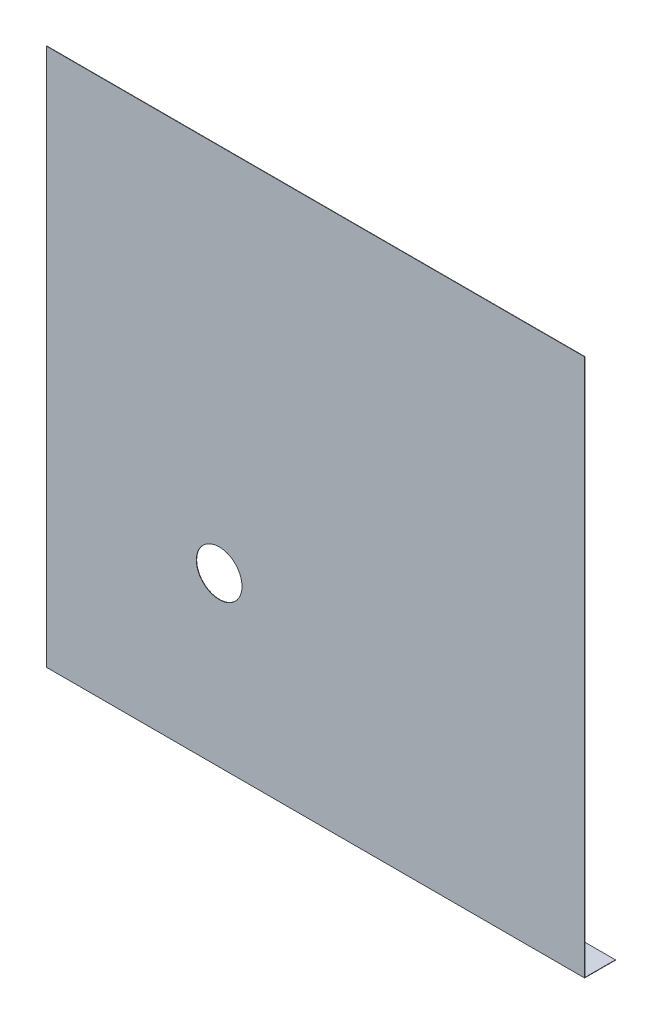
ISO-10303-21;
HEADER;
FILE_DESCRIPTION(('STEP AP214'),'2;1');
FILE_NAME('part.step','',(''),(''),'','','');
FILE_SCHEMA(('AUTOMOTIVE_DESIGN { 1 0 10303 214 1 1 1 1 }'));
ENDSEC;
DATA;
#1=APPLICATION_CONTEXT('core data for automotive mechanical design processes');
#2=APPLICATION_PROTOCOL_DEFINITION('international standard','automotive_design',2000,#1);
#3=PRODUCT_CONTEXT('',#1,'mechanical');
#4=PRODUCT('Part','Part','',(#3));
#5=PRODUCT_RELATED_PRODUCT_CATEGORY('part','',(#4));
#6=PRODUCT_DEFINITION_FORMATION('','',#4);
#7=PRODUCT_DEFINITION_CONTEXT('part definition',#1,'design');
#8=PRODUCT_DEFINITION('design','',#6,#7);
#9=PRODUCT_DEFINITION_SHAPE('','',#8);
#10=(LENGTH_UNIT() NAMED_UNIT(*) SI_UNIT(.MILLI.,.METRE.));
#11=(NAMED_UNIT(*) PLANE_ANGLE_UNIT() SI_UNIT($,.RADIAN.));
#12=(NAMED_UNIT(*) SI_UNIT($,.STERADIAN.) SOLID_ANGLE_UNIT());
#13=UNCERTAINTY_MEASURE_WITH_UNIT(LENGTH_MEASURE(1.E-05),#10,'distance_accuracy_value','');
#14=(GEOMETRIC_REPRESENTATION_CONTEXT(3) GLOBAL_UNCERTAINTY_ASSIGNED_CONTEXT((#13)) GLOBAL_UNIT_ASSIGNED_CONTEXT((#10,
#11,#12)) REPRESENTATION_CONTEXT('',''));
#15=CARTESIAN_POINT('',(0.,0.,0.));
#16=DIRECTION('',(0.,0.,1.));
#17=DIRECTION('',(1.,0.,0.));
#18=AXIS2_PLACEMENT_3D('',#15,#16,#17);
#19=CARTESIAN_POINT('',(530.,0.,0.));
#20=DIRECTION('',(0.,0.,-1.));
#21=DIRECTION('',(-1.,0.,0.));
#22=AXIS2_PLACEMENT_3D('',#19,#20,#21);
#23=PLANE('',#22);
#24=CARTESIAN_POINT('',(170.,165.35,0.));
#25=DIRECTION('',(0.,0.,-1.));
#26=DIRECTION('',(-1.,0.,0.));
#27=AXIS2_PLACEMENT_3D('',#24,#25,#26);
#28=CIRCLE('',#27,22.5);
#29=CARTESIAN_POINT('',(147.5,165.35,0.));
#30=VERTEX_POINT('',#29);
#31=EDGE_CURVE('E133',#30,#30,#28,.T.);
#32=ORIENTED_EDGE('',*,*,#31,.T.);
#33=EDGE_LOOP('',(#32));
#34=FACE_BOUND('',#33,.T.);
#35=DIRECTION('',(0.,-1.,0.));
#36=VECTOR('',#35,1.);
#37=CARTESIAN_POINT('',(0.,0.,0.));
#38=LINE('',#37,#36);
#39=CARTESIAN_POINT('',(0.,530.,0.));
#40=VERTEX_POINT('',#39);
#41=CARTESIAN_POINT('',(0.,0.,0.));
#42=VERTEX_POINT('',#41);
#43=EDGE_CURVE('E128',#40,#42,#38,.T.);
#44=ORIENTED_EDGE('',*,*,#43,.T.);
#45=DIRECTION('',(-1.,0.,0.));
#46=VECTOR('',#45,1.);
#47=CARTESIAN_POINT('',(530.,0.,0.));
#48=LINE('',#47,#46);
#49=CARTESIAN_POINT('',(530.,0.,0.));
#50=VERTEX_POINT('',#49);
#51=EDGE_CURVE('E11',#50,#42,#48,.T.);
#52=ORIENTED_EDGE('',*,*,#51,.F.);
#53=DIRECTION('',(0.,-1.,0.));
#54=VECTOR('',#53,1.);
#55=CARTESIAN_POINT('',(530.,0.,0.));
#56=LINE('',#55,#54);
#57=CARTESIAN_POINT('',(530.,530.,0.));
#58=VERTEX_POINT('',#57);
#59=EDGE_CURVE('E145',#58,#50,#56,.T.);
#60=ORIENTED_EDGE('',*,*,#59,.F.);
#61=DIRECTION('',(-1.,0.,0.));
#62=VECTOR('',#61,1.);
#63=CARTESIAN_POINT('',(530.,530.,0.));
#64=LINE('',#63,#62);
#65=EDGE_CURVE('E124',#58,#40,#64,.T.);
#66=ORIENTED_EDGE('',*,*,#65,.T.);
#67=EDGE_LOOP('',(#44,#52,#60,#66));
#68=FACE_BOUND('',#67,.T.);
#69=ADVANCED_FACE('F39',(#34,#68),#23,.F.);
#70=CARTESIAN_POINT('',(530.,0.,-30.3500000000001));
#71=DIRECTION('',(0.,1.,0.));
#72=DIRECTION('',(0.,0.,1.));
#73=AXIS2_PLACEMENT_3D('',#70,#71,#72);
#74=PLANE('',#73);
#75=DIRECTION('',(0.,0.,-1.));
#76=VECTOR('',#75,1.);
#77=CARTESIAN_POINT('',(0.,0.,-30.3500000000001));
#78=LINE('',#77,#76);
#79=CARTESIAN_POINT('',(0.,0.,-30.3500000000001));
#80=VERTEX_POINT('',#79);
#81=EDGE_CURVE('E132',#42,#80,#78,.T.);
#82=ORIENTED_EDGE('',*,*,#81,.T.);
#83=DIRECTION('',(-1.,0.,0.));
#84=VECTOR('',#83,1.);
#85=CARTESIAN_POINT('',(530.,0.,-30.3500000000001));
#86=LINE('',#85,#84);
#87=CARTESIAN_POINT('',(530.,0.,-30.3500000000001));
#88=VERTEX_POINT('',#87);
#89=EDGE_CURVE('E48',#88,#80,#86,.T.);
#90=ORIENTED_EDGE('',*,*,#89,.F.);
#91=DIRECTION('',(0.,0.,-1.));
#92=VECTOR('',#91,1.);
#93=CARTESIAN_POINT('',(530.,0.,-30.3500000000001));
#94=LINE('',#93,#92);
#95=EDGE_CURVE('E93',#50,#88,#94,.T.);
#96=ORIENTED_EDGE('',*,*,#95,.F.);
#97=ORIENTED_EDGE('',*,*,#51,.T.);
#98=EDGE_LOOP('',(#82,#90,#96,#97));
#99=FACE_BOUND('',#98,.T.);
#100=ADVANCED_FACE('F174',(#99),#74,.F.);
#101=CARTESIAN_POINT('',(530.,0.35,-30.3500000000001));
#102=DIRECTION('',(0.,0.,1.));
#103=DIRECTION('',(1.,0.,0.));
#104=AXIS2_PLACEMENT_3D('',#101,#102,#103);
#105=PLANE('',#104);
#106=DIRECTION('',(0.,1.,0.));
#107=VECTOR('',#106,1.);
#108=CARTESIAN_POINT('',(0.,0.35,-30.3500000000001));
#109=LINE('',#108,#107);
#110=CARTESIAN_POINT('',(0.,0.35,-30.3500000000001));
#111=VERTEX_POINT('',#110);
#112=EDGE_CURVE('E136',#80,#111,#109,.T.);
#113=ORIENTED_EDGE('',*,*,#112,.T.);
#114=DIRECTION('',(-1.,0.,0.));
#115=VECTOR('',#114,1.);
#116=CARTESIAN_POINT('',(530.,0.35,-30.3500000000001));
#117=LINE('',#116,#115);
#118=CARTESIAN_POINT('',(530.,0.35,-30.3500000000001));
#119=VERTEX_POINT('',#118);
#120=EDGE_CURVE('E117',#119,#111,#117,.T.);
#121=ORIENTED_EDGE('',*,*,#120,.F.);
#122=DIRECTION('',(0.,1.,0.));
#123=VECTOR('',#122,1.);
#124=CARTESIAN_POINT('',(530.,0.35,-30.3500000000001));
#125=LINE('',#124,#123);
#126=EDGE_CURVE('E106',#88,#119,#125,.T.);
#127=ORIENTED_EDGE('',*,*,#126,.F.);
#128=ORIENTED_EDGE('',*,*,#89,.T.);
#129=EDGE_LOOP('',(#113,#121,#127,#128));
#130=FACE_BOUND('',#129,.T.);
#131=ADVANCED_FACE('F155',(#130),#105,.F.);
#132=CARTESIAN_POINT('',(530.,0.35,-0.350000000000069));
#133=DIRECTION('',(0.,-1.,0.));
#134=DIRECTION('',(0.,0.,-1.));
#135=AXIS2_PLACEMENT_3D('',#132,#133,#134);
#136=PLANE('',#135);
#137=DIRECTION('',(0.,0.,1.));
#138=VECTOR('',#137,1.);
#139=CARTESIAN_POINT('',(0.,0.35,-0.350000000000069));
#140=LINE('',#139,#138);
#141=CARTESIAN_POINT('',(0.,0.35,-0.350000000000069));
#142=VERTEX_POINT('',#141);
#143=EDGE_CURVE('E115',#111,#142,#140,.T.);
#144=ORIENTED_EDGE('',*,*,#143,.T.);
#145=DIRECTION('',(-1.,0.,0.));
#146=VECTOR('',#145,1.);
#147=CARTESIAN_POINT('',(530.,0.35,-0.350000000000069));
#148=LINE('',#147,#146);
#149=CARTESIAN_POINT('',(530.,0.35,-0.350000000000069));
#150=VERTEX_POINT('',#149);
#151=EDGE_CURVE('E112',#150,#142,#148,.T.);
#152=ORIENTED_EDGE('',*,*,#151,.F.);
#153=DIRECTION('',(0.,0.,1.));
#154=VECTOR('',#153,1.);
#155=CARTESIAN_POINT('',(530.,0.35,-0.350000000000069));
#156=LINE('',#155,#154);
#157=EDGE_CURVE('E100',#119,#150,#156,.T.);
#158=ORIENTED_EDGE('',*,*,#157,.F.);
#159=ORIENTED_EDGE('',*,*,#120,.T.);
#160=EDGE_LOOP('',(#144,#152,#158,#159));
#161=FACE_BOUND('',#160,.T.);
#162=ADVANCED_FACE('F113',(#161),#136,.F.);
#163=CARTESIAN_POINT('',(530.,530.,-0.350000000000003));
#164=DIRECTION('',(0.,0.,1.));
#165=DIRECTION('',(0.,-1.,0.));
#166=AXIS2_PLACEMENT_3D('',#163,#164,#165);
#167=PLANE('',#166);
#168=CARTESIAN_POINT('',(170.,165.35,-0.350000000000048));
#169=DIRECTION('',(0.,0.,-1.));
#170=DIRECTION('',(0.,1.,0.));
#171=AXIS2_PLACEMENT_3D('',#168,#169,#170);
#172=CIRCLE('',#171,22.5);
#173=CARTESIAN_POINT('',(170.,187.85,-0.350000000000046));
#174=VERTEX_POINT('',#173);
#175=EDGE_CURVE('E183',#174,#174,#172,.T.);
#176=ORIENTED_EDGE('',*,*,#175,.F.);
#177=EDGE_LOOP('',(#176));
#178=FACE_BOUND('',#177,.T.);
#179=DIRECTION('',(0.,1.,0.));
#180=VECTOR('',#179,1.);
#181=CARTESIAN_POINT('',(0.,530.,-0.350000000000003));
#182=LINE('',#181,#180);
#183=CARTESIAN_POINT('',(0.,530.,-0.350000000000003));
#184=VERTEX_POINT('',#183);
#185=EDGE_CURVE('E79',#142,#184,#182,.T.);
#186=ORIENTED_EDGE('',*,*,#185,.T.);
#187=DIRECTION('',(-1.,0.,0.));
#188=VECTOR('',#187,1.);
#189=CARTESIAN_POINT('',(530.,530.,-0.350000000000003));
#190=LINE('',#189,#188);
#191=CARTESIAN_POINT('',(530.,530.,-0.350000000000003));
#192=VERTEX_POINT('',#191);
#193=EDGE_CURVE('E118',#192,#184,#190,.T.);
#194=ORIENTED_EDGE('',*,*,#193,.F.);
#195=DIRECTION('',(0.,1.,0.));
#196=VECTOR('',#195,1.);
#197=CARTESIAN_POINT('',(530.,530.,-0.350000000000003));
#198=LINE('',#197,#196);
#199=EDGE_CURVE('E104',#150,#192,#198,.T.);
#200=ORIENTED_EDGE('',*,*,#199,.F.);
#201=ORIENTED_EDGE('',*,*,#151,.T.);
#202=EDGE_LOOP('',(#186,#194,#200,#201));
#203=FACE_BOUND('',#202,.T.);
#204=ADVANCED_FACE('F120',(#178,#203),#167,.F.);
#205=CARTESIAN_POINT('',(530.,530.,0.));
#206=DIRECTION('',(0.,-1.,0.));
#207=DIRECTION('',(0.,0.,-1.));
#208=AXIS2_PLACEMENT_3D('',#205,#206,#207);
#209=PLANE('',#208);
#210=DIRECTION('',(0.,0.,1.));
#211=VECTOR('',#210,1.);
#212=CARTESIAN_POINT('',(0.,530.,0.));
#213=LINE('',#212,#211);
#214=EDGE_CURVE('E85',#184,#40,#213,.T.);
#215=ORIENTED_EDGE('',*,*,#214,.T.);
#216=ORIENTED_EDGE('',*,*,#65,.F.);
#217=DIRECTION('',(0.,0.,1.));
#218=VECTOR('',#217,1.);
#219=CARTESIAN_POINT('',(530.,530.,0.));
#220=LINE('',#219,#218);
#221=EDGE_CURVE('E56',#192,#58,#220,.T.);
#222=ORIENTED_EDGE('',*,*,#221,.F.);
#223=ORIENTED_EDGE('',*,*,#193,.T.);
#224=EDGE_LOOP('',(#215,#216,#222,#223));
#225=FACE_BOUND('',#224,.T.);
#226=ADVANCED_FACE('F162',(#225),#209,.F.);
#227=CARTESIAN_POINT('',(530.,0.,0.));
#228=DIRECTION('',(-1.,0.,0.));
#229=DIRECTION('',(0.,0.,1.));
#230=AXIS2_PLACEMENT_3D('',#227,#228,#229);
#231=PLANE('',#230);
#232=ORIENTED_EDGE('',*,*,#59,.T.);
#233=ORIENTED_EDGE('',*,*,#95,.T.);
#234=ORIENTED_EDGE('',*,*,#126,.T.);
#235=ORIENTED_EDGE('',*,*,#157,.T.);
#236=ORIENTED_EDGE('',*,*,#199,.T.);
#237=ORIENTED_EDGE('',*,*,#221,.T.);
#238=EDGE_LOOP('',(#232,#233,#234,#235,#236,#237));
#239=FACE_BOUND('',#238,.T.);
#240=ADVANCED_FACE('F102',(#239),#231,.F.);
#241=CARTESIAN_POINT('',(0.,0.,0.));
#242=DIRECTION('',(-1.,0.,0.));
#243=DIRECTION('',(0.,0.,1.));
#244=AXIS2_PLACEMENT_3D('',#241,#242,#243);
#245=PLANE('',#244);
#246=ORIENTED_EDGE('',*,*,#43,.F.);
#247=ORIENTED_EDGE('',*,*,#214,.F.);
#248=ORIENTED_EDGE('',*,*,#185,.F.);
#249=ORIENTED_EDGE('',*,*,#143,.F.);
#250=ORIENTED_EDGE('',*,*,#112,.F.);
#251=ORIENTED_EDGE('',*,*,#81,.F.);
#252=EDGE_LOOP('',(#246,#247,#248,#249,#250,#251));
#253=FACE_BOUND('',#252,.T.);
#254=ADVANCED_FACE('F158',(#253),#245,.T.);
#255=CARTESIAN_POINT('',(170.,165.35,529.65));
#256=DIRECTION('',(0.,0.,-1.));
#257=DIRECTION('',(0.,1.,0.));
#258=AXIS2_PLACEMENT_3D('',#255,#256,#257);
#259=CYLINDRICAL_SURFACE('',#258,22.5);
#260=ORIENTED_EDGE('',*,*,#175,.T.);
#261=EDGE_LOOP('',(#260));
#262=FACE_BOUND('',#261,.T.);
#263=ORIENTED_EDGE('',*,*,#31,.F.);
#264=EDGE_LOOP('',(#263));
#265=FACE_BOUND('',#264,.T.);
#266=ADVANCED_FACE('F195',(#262,#265),#259,.F.);
#267=CLOSED_SHELL('',(#69,#100,#131,#162,#204,#226,#240,#254,#266));
#268=MANIFOLD_SOLID_BREP('B2',#267);
#269=ADVANCED_BREP_SHAPE_REPRESENTATION('',(#18,#268),#14);
#270=SHAPE_DEFINITION_REPRESENTATION(#9,#269);
ENDSEC;
END-ISO-10303-21;
